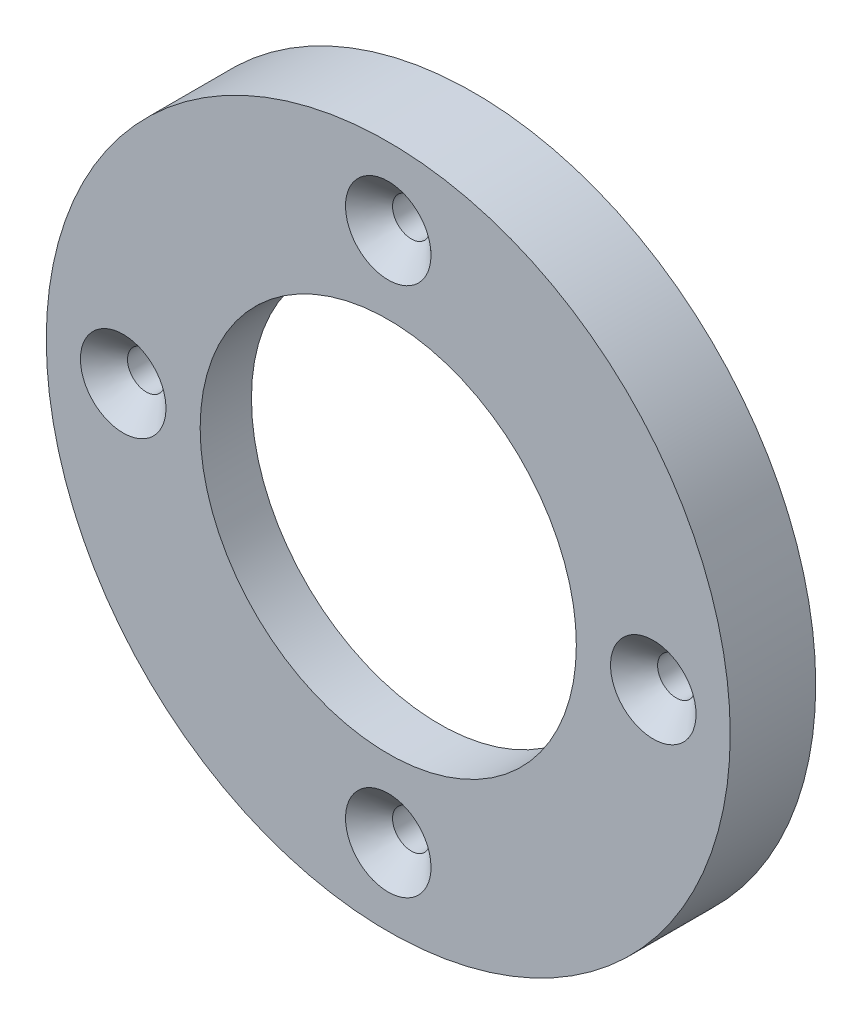
ISO-10303-21;
HEADER;
FILE_DESCRIPTION(('STEP AP214'),'2;1');
FILE_NAME('part.step','',(''),(''),'','','');
FILE_SCHEMA(('AUTOMOTIVE_DESIGN { 1 0 10303 214 1 1 1 1 }'));
ENDSEC;
DATA;
#1=APPLICATION_CONTEXT('core data for automotive mechanical design processes');
#2=APPLICATION_PROTOCOL_DEFINITION('international standard','automotive_design',2000,#1);
#3=PRODUCT_CONTEXT('',#1,'mechanical');
#4=PRODUCT('Part','Part','',(#3));
#5=PRODUCT_RELATED_PRODUCT_CATEGORY('part','',(#4));
#6=PRODUCT_DEFINITION_FORMATION('','',#4);
#7=PRODUCT_DEFINITION_CONTEXT('part definition',#1,'design');
#8=PRODUCT_DEFINITION('design','',#6,#7);
#9=PRODUCT_DEFINITION_SHAPE('','',#8);
#10=(LENGTH_UNIT() NAMED_UNIT(*) SI_UNIT(.MILLI.,.METRE.));
#11=(NAMED_UNIT(*) PLANE_ANGLE_UNIT() SI_UNIT($,.RADIAN.));
#12=(NAMED_UNIT(*) SI_UNIT($,.STERADIAN.) SOLID_ANGLE_UNIT());
#13=UNCERTAINTY_MEASURE_WITH_UNIT(LENGTH_MEASURE(1.E-05),#10,'distance_accuracy_value','');
#14=(GEOMETRIC_REPRESENTATION_CONTEXT(3) GLOBAL_UNCERTAINTY_ASSIGNED_CONTEXT((#13)) GLOBAL_UNIT_ASSIGNED_CONTEXT((#10,
#11,#12)) REPRESENTATION_CONTEXT('',''));
#15=CARTESIAN_POINT('',(0.,0.,0.));
#16=DIRECTION('',(0.,0.,1.));
#17=DIRECTION('',(1.,0.,0.));
#18=AXIS2_PLACEMENT_3D('',#15,#16,#17);
#19=CARTESIAN_POINT('',(0.,0.,3.));
#20=DIRECTION('',(0.,0.,1.));
#21=DIRECTION('',(1.,0.,0.));
#22=AXIS2_PLACEMENT_3D('',#19,#20,#21);
#23=PLANE('',#22);
#24=CARTESIAN_POINT('',(-1.62353882256206E-13,15.5,3.));
#25=DIRECTION('',(0.,0.,-1.));
#26=DIRECTION('',(0.,1.,0.));
#27=AXIS2_PLACEMENT_3D('',#24,#25,#26);
#28=CIRCLE('',#27,2.5);
#29=CARTESIAN_POINT('',(-1.88539992297529E-13,18.,3.));
#30=VERTEX_POINT('',#29);
#31=EDGE_CURVE('E99',#30,#30,#28,.T.);
#32=ORIENTED_EDGE('',*,*,#31,.T.);
#33=EDGE_LOOP('',(#32));
#34=FACE_BOUND('',#33,.T.);
#35=CARTESIAN_POINT('',(15.5,0.,3.));
#36=DIRECTION('',(0.,0.,-1.));
#37=DIRECTION('',(1.,0.,0.));
#38=AXIS2_PLACEMENT_3D('',#35,#36,#37);
#39=CIRCLE('',#38,2.5);
#40=CARTESIAN_POINT('',(18.,0.,3.));
#41=VERTEX_POINT('',#40);
#42=EDGE_CURVE('E58',#41,#41,#39,.T.);
#43=ORIENTED_EDGE('',*,*,#42,.T.);
#44=EDGE_LOOP('',(#43));
#45=FACE_BOUND('',#44,.T.);
#46=CARTESIAN_POINT('',(0.,-15.5,3.));
#47=DIRECTION('',(0.,0.,-1.));
#48=DIRECTION('',(0.,-1.,0.));
#49=AXIS2_PLACEMENT_3D('',#46,#47,#48);
#50=CIRCLE('',#49,2.5);
#51=CARTESIAN_POINT('',(0.,-18.,3.));
#52=VERTEX_POINT('',#51);
#53=EDGE_CURVE('E63',#52,#52,#50,.T.);
#54=ORIENTED_EDGE('',*,*,#53,.T.);
#55=EDGE_LOOP('',(#54));
#56=FACE_BOUND('',#55,.T.);
#57=CARTESIAN_POINT('',(-15.5,0.,3.));
#58=DIRECTION('',(0.,0.,-1.));
#59=DIRECTION('',(-1.,0.,0.));
#60=AXIS2_PLACEMENT_3D('',#57,#58,#59);
#61=CIRCLE('',#60,2.5);
#62=CARTESIAN_POINT('',(-18.,0.,3.));
#63=VERTEX_POINT('',#62);
#64=EDGE_CURVE('E68',#63,#63,#61,.T.);
#65=ORIENTED_EDGE('',*,*,#64,.T.);
#66=EDGE_LOOP('',(#65));
#67=FACE_BOUND('',#66,.T.);
#68=CARTESIAN_POINT('',(0.,0.,3.));
#69=DIRECTION('',(0.,0.,1.));
#70=DIRECTION('',(1.,0.,0.));
#71=AXIS2_PLACEMENT_3D('',#68,#69,#70);
#72=CIRCLE('',#71,11.);
#73=CARTESIAN_POINT('',(11.,0.,3.));
#74=VERTEX_POINT('',#73);
#75=EDGE_CURVE('E75',#74,#74,#72,.T.);
#76=ORIENTED_EDGE('',*,*,#75,.F.);
#77=EDGE_LOOP('',(#76));
#78=FACE_BOUND('',#77,.T.);
#79=CARTESIAN_POINT('',(0.,0.,3.));
#80=DIRECTION('',(0.,0.,1.));
#81=DIRECTION('',(1.,0.,0.));
#82=AXIS2_PLACEMENT_3D('',#79,#80,#81);
#83=CIRCLE('',#82,20.);
#84=CARTESIAN_POINT('',(20.,0.,3.));
#85=VERTEX_POINT('',#84);
#86=EDGE_CURVE('E72',#85,#85,#83,.T.);
#87=ORIENTED_EDGE('',*,*,#86,.T.);
#88=EDGE_LOOP('',(#87));
#89=FACE_BOUND('',#88,.T.);
#90=ADVANCED_FACE('F37',(#34,#45,#56,#67,#78,#89),#23,.T.);
#91=CARTESIAN_POINT('',(0.,0.,0.));
#92=DIRECTION('',(0.,0.,1.));
#93=DIRECTION('',(1.,0.,0.));
#94=AXIS2_PLACEMENT_3D('',#91,#92,#93);
#95=PLANE('',#94);
#96=CARTESIAN_POINT('',(-1.62353882256206E-13,15.5,0.));
#97=DIRECTION('',(0.,0.,1.));
#98=DIRECTION('',(1.,0.,0.));
#99=AXIS2_PLACEMENT_3D('',#96,#97,#98);
#100=CIRCLE('',#99,1.1);
#101=CARTESIAN_POINT('',(1.09999999999984,15.5,0.));
#102=VERTEX_POINT('',#101);
#103=EDGE_CURVE('E55',#102,#102,#100,.T.);
#104=ORIENTED_EDGE('',*,*,#103,.T.);
#105=EDGE_LOOP('',(#104));
#106=FACE_BOUND('',#105,.T.);
#107=CARTESIAN_POINT('',(15.5,0.,0.));
#108=DIRECTION('',(0.,0.,1.));
#109=DIRECTION('',(1.,0.,0.));
#110=AXIS2_PLACEMENT_3D('',#107,#108,#109);
#111=CIRCLE('',#110,1.1);
#112=CARTESIAN_POINT('',(16.6,0.,0.));
#113=VERTEX_POINT('',#112);
#114=EDGE_CURVE('E60',#113,#113,#111,.T.);
#115=ORIENTED_EDGE('',*,*,#114,.T.);
#116=EDGE_LOOP('',(#115));
#117=FACE_BOUND('',#116,.T.);
#118=CARTESIAN_POINT('',(0.,-15.5,0.));
#119=DIRECTION('',(0.,0.,1.));
#120=DIRECTION('',(1.,0.,0.));
#121=AXIS2_PLACEMENT_3D('',#118,#119,#120);
#122=CIRCLE('',#121,1.1);
#123=CARTESIAN_POINT('',(1.10000000000006,-15.5,0.));
#124=VERTEX_POINT('',#123);
#125=EDGE_CURVE('E65',#124,#124,#122,.T.);
#126=ORIENTED_EDGE('',*,*,#125,.T.);
#127=EDGE_LOOP('',(#126));
#128=FACE_BOUND('',#127,.T.);
#129=CARTESIAN_POINT('',(-15.5,0.,0.));
#130=DIRECTION('',(0.,0.,1.));
#131=DIRECTION('',(1.,0.,0.));
#132=AXIS2_PLACEMENT_3D('',#129,#130,#131);
#133=CIRCLE('',#132,1.1);
#134=CARTESIAN_POINT('',(-14.4,0.,0.));
#135=VERTEX_POINT('',#134);
#136=EDGE_CURVE('E70',#135,#135,#133,.T.);
#137=ORIENTED_EDGE('',*,*,#136,.T.);
#138=EDGE_LOOP('',(#137));
#139=FACE_BOUND('',#138,.T.);
#140=CARTESIAN_POINT('',(0.,0.,0.));
#141=DIRECTION('',(0.,0.,1.));
#142=DIRECTION('',(1.,0.,0.));
#143=AXIS2_PLACEMENT_3D('',#140,#141,#142);
#144=CIRCLE('',#143,11.);
#145=CARTESIAN_POINT('',(11.,0.,0.));
#146=VERTEX_POINT('',#145);
#147=EDGE_CURVE('E52',#146,#146,#144,.T.);
#148=ORIENTED_EDGE('',*,*,#147,.T.);
#149=EDGE_LOOP('',(#148));
#150=FACE_BOUND('',#149,.T.);
#151=CARTESIAN_POINT('',(0.,0.,0.));
#152=DIRECTION('',(0.,0.,1.));
#153=DIRECTION('',(1.,0.,0.));
#154=AXIS2_PLACEMENT_3D('',#151,#152,#153);
#155=CIRCLE('',#154,18.);
#156=CARTESIAN_POINT('',(18.,0.,0.));
#157=VERTEX_POINT('',#156);
#158=EDGE_CURVE('E48',#157,#157,#155,.T.);
#159=ORIENTED_EDGE('',*,*,#158,.F.);
#160=EDGE_LOOP('',(#159));
#161=FACE_BOUND('',#160,.T.);
#162=ADVANCED_FACE('F118',(#106,#117,#128,#139,#150,#161),#95,.F.);
#163=CARTESIAN_POINT('',(0.,0.,0.));
#164=DIRECTION('',(0.,0.,1.));
#165=DIRECTION('',(1.,0.,0.));
#166=AXIS2_PLACEMENT_3D('',#163,#164,#165);
#167=CYLINDRICAL_SURFACE('',#166,11.);
#168=ORIENTED_EDGE('',*,*,#147,.F.);
#169=EDGE_LOOP('',(#168));
#170=FACE_BOUND('',#169,.T.);
#171=ORIENTED_EDGE('',*,*,#75,.T.);
#172=EDGE_LOOP('',(#171));
#173=FACE_BOUND('',#172,.T.);
#174=ADVANCED_FACE('F121',(#170,#173),#167,.F.);
#175=CARTESIAN_POINT('',(0.,0.,-2.));
#176=DIRECTION('',(0.,0.,1.));
#177=DIRECTION('',(1.,0.,0.));
#178=AXIS2_PLACEMENT_3D('',#175,#176,#177);
#179=CYLINDRICAL_SURFACE('',#178,18.);
#180=CARTESIAN_POINT('',(0.,0.,-1.49999999999999));
#181=DIRECTION('',(0.,0.,1.));
#182=DIRECTION('',(1.,0.,0.));
#183=AXIS2_PLACEMENT_3D('',#180,#181,#182);
#184=CIRCLE('',#183,18.);
#185=CARTESIAN_POINT('',(18.,0.,-1.49999999999999));
#186=VERTEX_POINT('',#185);
#187=EDGE_CURVE('E10',#186,#186,#184,.F.);
#188=ORIENTED_EDGE('',*,*,#187,.T.);
#189=EDGE_LOOP('',(#188));
#190=FACE_BOUND('',#189,.T.);
#191=ORIENTED_EDGE('',*,*,#158,.T.);
#192=EDGE_LOOP('',(#191));
#193=FACE_BOUND('',#192,.T.);
#194=ADVANCED_FACE('F132',(#190,#193),#179,.F.);
#195=CARTESIAN_POINT('',(0.,0.,-2.));
#196=DIRECTION('',(0.,0.,1.));
#197=DIRECTION('',(1.,0.,0.));
#198=AXIS2_PLACEMENT_3D('',#195,#196,#197);
#199=CYLINDRICAL_SURFACE('',#198,20.);
#200=CARTESIAN_POINT('',(0.,0.,-2.));
#201=DIRECTION('',(0.,0.,1.));
#202=DIRECTION('',(1.,0.,0.));
#203=AXIS2_PLACEMENT_3D('',#200,#201,#202);
#204=CIRCLE('',#203,20.);
#205=CARTESIAN_POINT('',(20.,0.,-2.));
#206=VERTEX_POINT('',#205);
#207=EDGE_CURVE('E78',#206,#206,#204,.T.);
#208=ORIENTED_EDGE('',*,*,#207,.T.);
#209=EDGE_LOOP('',(#208));
#210=FACE_BOUND('',#209,.T.);
#211=ORIENTED_EDGE('',*,*,#86,.F.);
#212=EDGE_LOOP('',(#211));
#213=FACE_BOUND('',#212,.T.);
#214=ADVANCED_FACE('F134',(#210,#213),#199,.T.);
#215=CARTESIAN_POINT('',(0.,0.,-2.));
#216=DIRECTION('',(0.,0.,1.));
#217=DIRECTION('',(1.,0.,0.));
#218=AXIS2_PLACEMENT_3D('',#215,#216,#217);
#219=PLANE('',#218);
#220=CARTESIAN_POINT('',(0.,0.,-2.));
#221=DIRECTION('',(0.,0.,1.));
#222=DIRECTION('',(1.,0.,0.));
#223=AXIS2_PLACEMENT_3D('',#220,#221,#222);
#224=CIRCLE('',#223,18.5);
#225=CARTESIAN_POINT('',(18.5,0.,-2.));
#226=VERTEX_POINT('',#225);
#227=EDGE_CURVE('E44',#226,#226,#224,.T.);
#228=ORIENTED_EDGE('',*,*,#227,.T.);
#229=EDGE_LOOP('',(#228));
#230=FACE_BOUND('',#229,.T.);
#231=ORIENTED_EDGE('',*,*,#207,.F.);
#232=EDGE_LOOP('',(#231));
#233=FACE_BOUND('',#232,.T.);
#234=ADVANCED_FACE('F140',(#230,#233),#219,.F.);
#235=CARTESIAN_POINT('',(-15.5,0.,-24.0808517995533));
#236=DIRECTION('',(0.,0.,-1.));
#237=DIRECTION('',(-1.,0.,0.));
#238=AXIS2_PLACEMENT_3D('',#235,#236,#237);
#239=CYLINDRICAL_SURFACE('',#238,1.1);
#240=CARTESIAN_POINT('',(-15.5,0.,1.64803571527008));
#241=DIRECTION('',(0.,0.,-1.));
#242=DIRECTION('',(-1.,0.,0.));
#243=AXIS2_PLACEMENT_3D('',#240,#241,#242);
#244=CIRCLE('',#243,1.1);
#245=CARTESIAN_POINT('',(-16.6,0.,1.64803571527008));
#246=VERTEX_POINT('',#245);
#247=EDGE_CURVE('E73',#246,#246,#244,.T.);
#248=ORIENTED_EDGE('',*,*,#247,.F.);
#249=EDGE_LOOP('',(#248));
#250=FACE_BOUND('',#249,.T.);
#251=ORIENTED_EDGE('',*,*,#136,.F.);
#252=EDGE_LOOP('',(#251));
#253=FACE_BOUND('',#252,.T.);
#254=ADVANCED_FACE('F152',(#250,#253),#239,.F.);
#255=CARTESIAN_POINT('',(-15.5,0.,1.64803571527008));
#256=DIRECTION('',(0.,0.,1.));
#257=DIRECTION('',(1.,0.,0.));
#258=AXIS2_PLACEMENT_3D('',#255,#256,#257);
#259=CONICAL_SURFACE('',#258,1.1,0.802851455917386);
#260=ORIENTED_EDGE('',*,*,#64,.F.);
#261=EDGE_LOOP('',(#260));
#262=FACE_BOUND('',#261,.T.);
#263=ORIENTED_EDGE('',*,*,#247,.T.);
#264=EDGE_LOOP('',(#263));
#265=FACE_BOUND('',#264,.T.);
#266=ADVANCED_FACE('F156',(#262,#265),#259,.F.);
#267=CARTESIAN_POINT('',(0.,-15.5,-24.0808517995533));
#268=DIRECTION('',(0.,0.,-1.));
#269=DIRECTION('',(0.,-1.,0.));
#270=AXIS2_PLACEMENT_3D('',#267,#268,#269);
#271=CYLINDRICAL_SURFACE('',#270,1.1);
#272=CARTESIAN_POINT('',(0.,-15.5,1.64803571527008));
#273=DIRECTION('',(0.,0.,-1.));
#274=DIRECTION('',(0.,-1.,0.));
#275=AXIS2_PLACEMENT_3D('',#272,#273,#274);
#276=CIRCLE('',#275,1.1);
#277=CARTESIAN_POINT('',(0.,-16.6,1.64803571527008));
#278=VERTEX_POINT('',#277);
#279=EDGE_CURVE('E69',#278,#278,#276,.T.);
#280=ORIENTED_EDGE('',*,*,#279,.F.);
#281=EDGE_LOOP('',(#280));
#282=FACE_BOUND('',#281,.T.);
#283=ORIENTED_EDGE('',*,*,#125,.F.);
#284=EDGE_LOOP('',(#283));
#285=FACE_BOUND('',#284,.T.);
#286=ADVANCED_FACE('F166',(#282,#285),#271,.F.);
#287=CARTESIAN_POINT('',(0.,-15.5,1.64803571527008));
#288=DIRECTION('',(0.,0.,1.));
#289=DIRECTION('',(0.,1.,0.));
#290=AXIS2_PLACEMENT_3D('',#287,#288,#289);
#291=CONICAL_SURFACE('',#290,1.1,0.802851455917386);
#292=ORIENTED_EDGE('',*,*,#53,.F.);
#293=EDGE_LOOP('',(#292));
#294=FACE_BOUND('',#293,.T.);
#295=ORIENTED_EDGE('',*,*,#279,.T.);
#296=EDGE_LOOP('',(#295));
#297=FACE_BOUND('',#296,.T.);
#298=ADVANCED_FACE('F174',(#294,#297),#291,.F.);
#299=CARTESIAN_POINT('',(15.5,0.,-24.0808517995533));
#300=DIRECTION('',(0.,0.,-1.));
#301=DIRECTION('',(1.,0.,0.));
#302=AXIS2_PLACEMENT_3D('',#299,#300,#301);
#303=CYLINDRICAL_SURFACE('',#302,1.1);
#304=CARTESIAN_POINT('',(15.5,0.,1.64803571527008));
#305=DIRECTION('',(0.,0.,-1.));
#306=DIRECTION('',(1.,0.,0.));
#307=AXIS2_PLACEMENT_3D('',#304,#305,#306);
#308=CIRCLE('',#307,1.1);
#309=CARTESIAN_POINT('',(16.6,0.,1.64803571527008));
#310=VERTEX_POINT('',#309);
#311=EDGE_CURVE('E64',#310,#310,#308,.T.);
#312=ORIENTED_EDGE('',*,*,#311,.F.);
#313=EDGE_LOOP('',(#312));
#314=FACE_BOUND('',#313,.T.);
#315=ORIENTED_EDGE('',*,*,#114,.F.);
#316=EDGE_LOOP('',(#315));
#317=FACE_BOUND('',#316,.T.);
#318=ADVANCED_FACE('F178',(#314,#317),#303,.F.);
#319=CARTESIAN_POINT('',(15.5,0.,1.64803571527008));
#320=DIRECTION('',(0.,0.,1.));
#321=DIRECTION('',(-1.,0.,0.));
#322=AXIS2_PLACEMENT_3D('',#319,#320,#321);
#323=CONICAL_SURFACE('',#322,1.1,0.802851455917386);
#324=ORIENTED_EDGE('',*,*,#42,.F.);
#325=EDGE_LOOP('',(#324));
#326=FACE_BOUND('',#325,.T.);
#327=ORIENTED_EDGE('',*,*,#311,.T.);
#328=EDGE_LOOP('',(#327));
#329=FACE_BOUND('',#328,.T.);
#330=ADVANCED_FACE('F114',(#326,#329),#323,.F.);
#331=CARTESIAN_POINT('',(-1.62353882256206E-13,15.5,-24.0808517995533));
#332=DIRECTION('',(0.,0.,-1.));
#333=DIRECTION('',(0.,1.,0.));
#334=AXIS2_PLACEMENT_3D('',#331,#332,#333);
#335=CYLINDRICAL_SURFACE('',#334,1.1);
#336=CARTESIAN_POINT('',(-1.62353882256206E-13,15.5,1.64803571527008));
#337=DIRECTION('',(0.,0.,-1.));
#338=DIRECTION('',(0.,1.,0.));
#339=AXIS2_PLACEMENT_3D('',#336,#337,#338);
#340=CIRCLE('',#339,1.1);
#341=CARTESIAN_POINT('',(-1.73875770674388E-13,16.6,1.64803571527008));
#342=VERTEX_POINT('',#341);
#343=EDGE_CURVE('E59',#342,#342,#340,.T.);
#344=ORIENTED_EDGE('',*,*,#343,.F.);
#345=EDGE_LOOP('',(#344));
#346=FACE_BOUND('',#345,.T.);
#347=ORIENTED_EDGE('',*,*,#103,.F.);
#348=EDGE_LOOP('',(#347));
#349=FACE_BOUND('',#348,.T.);
#350=ADVANCED_FACE('F108',(#346,#349),#335,.F.);
#351=CARTESIAN_POINT('',(-1.62353882256206E-13,15.5,1.64803571527008));
#352=DIRECTION('',(0.,0.,1.));
#353=DIRECTION('',(0.,-1.,0.));
#354=AXIS2_PLACEMENT_3D('',#351,#352,#353);
#355=CONICAL_SURFACE('',#354,1.1,0.802851455917386);
#356=ORIENTED_EDGE('',*,*,#31,.F.);
#357=EDGE_LOOP('',(#356));
#358=FACE_BOUND('',#357,.T.);
#359=ORIENTED_EDGE('',*,*,#343,.T.);
#360=EDGE_LOOP('',(#359));
#361=FACE_BOUND('',#360,.T.);
#362=ADVANCED_FACE('F105',(#358,#361),#355,.F.);
#363=CARTESIAN_POINT('',(0.,0.,-2.));
#364=DIRECTION('',(0.,0.,-1.));
#365=DIRECTION('',(-1.,0.,0.));
#366=AXIS2_PLACEMENT_3D('',#363,#364,#365);
#367=CONICAL_SURFACE('',#366,18.5,0.785398163397441);
#368=ORIENTED_EDGE('',*,*,#187,.F.);
#369=EDGE_LOOP('',(#368));
#370=FACE_BOUND('',#369,.T.);
#371=ORIENTED_EDGE('',*,*,#227,.F.);
#372=EDGE_LOOP('',(#371));
#373=FACE_BOUND('',#372,.T.);
#374=ADVANCED_FACE('F39',(#370,#373),#367,.F.);
#375=CLOSED_SHELL('',(#90,#162,#174,#194,#214,#234,#254,#266,#286,#298,#318,#330,#350,#362,#374));
#376=MANIFOLD_SOLID_BREP('B2',#375);
#377=ADVANCED_BREP_SHAPE_REPRESENTATION('',(#18,#376),#14);
#378=SHAPE_DEFINITION_REPRESENTATION(#9,#377);
ENDSEC;
END-ISO-10303-21;
